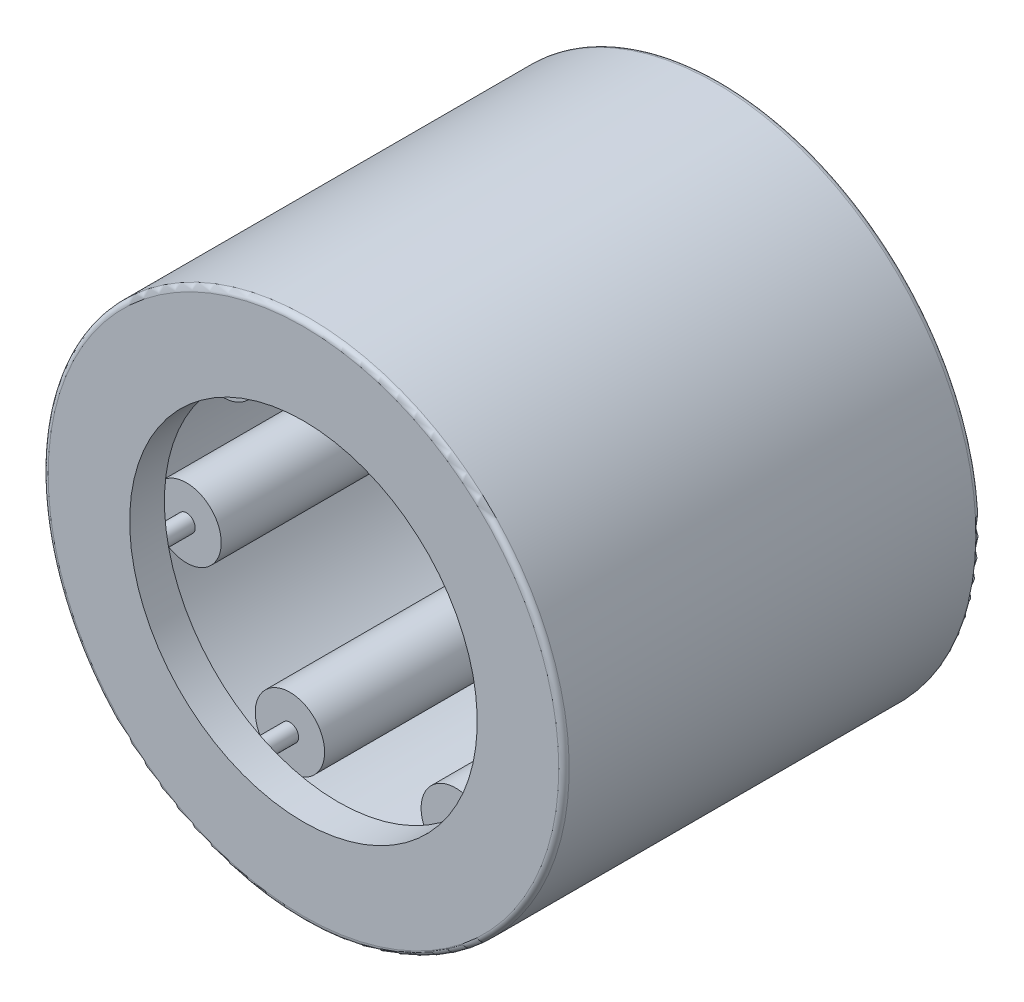
ISO-10303-21;
HEADER;
FILE_DESCRIPTION(('STEP AP214'),'2;1');
FILE_NAME('part.step','',(''),(''),'','','');
FILE_SCHEMA(('AUTOMOTIVE_DESIGN { 1 0 10303 214 1 1 1 1 }'));
ENDSEC;
DATA;
#1=APPLICATION_CONTEXT('core data for automotive mechanical design processes');
#2=APPLICATION_PROTOCOL_DEFINITION('international standard','automotive_design',2000,#1);
#3=PRODUCT_CONTEXT('',#1,'mechanical');
#4=PRODUCT('Part','Part','',(#3));
#5=PRODUCT_RELATED_PRODUCT_CATEGORY('part','',(#4));
#6=PRODUCT_DEFINITION_FORMATION('','',#4);
#7=PRODUCT_DEFINITION_CONTEXT('part definition',#1,'design');
#8=PRODUCT_DEFINITION('design','',#6,#7);
#9=PRODUCT_DEFINITION_SHAPE('','',#8);
#10=(LENGTH_UNIT() NAMED_UNIT(*) SI_UNIT(.MILLI.,.METRE.));
#11=(NAMED_UNIT(*) PLANE_ANGLE_UNIT() SI_UNIT($,.RADIAN.));
#12=(NAMED_UNIT(*) SI_UNIT($,.STERADIAN.) SOLID_ANGLE_UNIT());
#13=UNCERTAINTY_MEASURE_WITH_UNIT(LENGTH_MEASURE(1.E-05),#10,'distance_accuracy_value','');
#14=(GEOMETRIC_REPRESENTATION_CONTEXT(3) GLOBAL_UNCERTAINTY_ASSIGNED_CONTEXT((#13)) GLOBAL_UNIT_ASSIGNED_CONTEXT((#10,
#11,#12)) REPRESENTATION_CONTEXT('',''));
#15=CARTESIAN_POINT('',(0.,0.,0.));
#16=DIRECTION('',(0.,0.,1.));
#17=DIRECTION('',(1.,0.,0.));
#18=AXIS2_PLACEMENT_3D('',#15,#16,#17);
#19=CARTESIAN_POINT('',(-3.386112150569,2.70033433185022,-2.669));
#20=DIRECTION('',(0.,0.,1.));
#21=DIRECTION('',(0.781831482468022,-0.623489801858743,0.));
#22=AXIS2_PLACEMENT_3D('',#19,#20,#21);
#23=PLANE('',#22);
#24=CARTESIAN_POINT('',(-2.86580329898654,2.28540186871322,-2.669));
#25=DIRECTION('',(0.,0.,1.));
#26=DIRECTION('',(0.781831482468022,-0.623489801858743,0.));
#27=AXIS2_PLACEMENT_3D('',#24,#25,#26);
#28=CIRCLE('',#27,0.665499999999999);
#29=CARTESIAN_POINT('',(-2.34549444740407,1.87046940557623,-2.669));
#30=VERTEX_POINT('',#29);
#31=EDGE_CURVE('E11',#30,#30,#28,.T.);
#32=ORIENTED_EDGE('',*,*,#31,.F.);
#33=EDGE_LOOP('',(#32));
#34=FACE_BOUND('',#33,.T.);
#35=CARTESIAN_POINT('',(-2.86580329898654,2.28540186871322,-2.669));
#36=DIRECTION('',(0.,0.,1.));
#37=DIRECTION('',(0.781831482468022,-0.623489801858743,0.));
#38=AXIS2_PLACEMENT_3D('',#35,#36,#37);
#39=CIRCLE('',#38,0.166374999999999);
#40=CARTESIAN_POINT('',(-2.73572608609092,2.18166875292898,-2.669));
#41=VERTEX_POINT('',#40);
#42=EDGE_CURVE('E55',#41,#41,#39,.T.);
#43=ORIENTED_EDGE('',*,*,#42,.T.);
#44=EDGE_LOOP('',(#43));
#45=FACE_BOUND('',#44,.T.);
#46=ADVANCED_FACE('F41',(#34,#45),#23,.F.);
#47=CARTESIAN_POINT('',(-2.86580329898654,2.28540186871322,2.669));
#48=DIRECTION('',(0.,0.,1.));
#49=DIRECTION('',(0.781831482468022,-0.623489801858743,0.));
#50=AXIS2_PLACEMENT_3D('',#47,#48,#49);
#51=CYLINDRICAL_SURFACE('',#50,0.665499999999999);
#52=CARTESIAN_POINT('',(-2.86580329898654,2.28540186871322,2.669));
#53=DIRECTION('',(0.,0.,1.));
#54=DIRECTION('',(0.781831482468022,-0.623489801858743,0.));
#55=AXIS2_PLACEMENT_3D('',#52,#53,#54);
#56=CIRCLE('',#55,0.665499999999999);
#57=CARTESIAN_POINT('',(-2.34549444740407,1.87046940557623,2.669));
#58=VERTEX_POINT('',#57);
#59=EDGE_CURVE('E47',#58,#58,#56,.T.);
#60=ORIENTED_EDGE('',*,*,#59,.F.);
#61=EDGE_LOOP('',(#60));
#62=FACE_BOUND('',#61,.T.);
#63=ORIENTED_EDGE('',*,*,#31,.T.);
#64=EDGE_LOOP('',(#63));
#65=FACE_BOUND('',#64,.T.);
#66=ADVANCED_FACE('F70',(#62,#65),#51,.T.);
#67=CARTESIAN_POINT('',(-3.386112150569,2.70033433185022,2.669));
#68=DIRECTION('',(0.,0.,-1.));
#69=DIRECTION('',(-0.781831482468022,0.623489801858743,0.));
#70=AXIS2_PLACEMENT_3D('',#67,#68,#69);
#71=PLANE('',#70);
#72=CARTESIAN_POINT('',(-2.86580329898654,2.28540186871322,2.669));
#73=DIRECTION('',(0.,0.,1.));
#74=DIRECTION('',(0.781831482468022,-0.623489801858743,0.));
#75=AXIS2_PLACEMENT_3D('',#72,#73,#74);
#76=CIRCLE('',#75,0.166374999999999);
#77=CARTESIAN_POINT('',(-2.73572608609092,2.18166875292898,2.669));
#78=VERTEX_POINT('',#77);
#79=EDGE_CURVE('E51',#78,#78,#76,.T.);
#80=ORIENTED_EDGE('',*,*,#79,.F.);
#81=EDGE_LOOP('',(#80));
#82=FACE_BOUND('',#81,.T.);
#83=ORIENTED_EDGE('',*,*,#59,.T.);
#84=EDGE_LOOP('',(#83));
#85=FACE_BOUND('',#84,.T.);
#86=ADVANCED_FACE('F65',(#82,#85),#71,.F.);
#87=CARTESIAN_POINT('',(-2.86580329898654,2.28540186871322,2.669));
#88=DIRECTION('',(0.,0.,1.));
#89=DIRECTION('',(0.781831482468022,-0.623489801858743,0.));
#90=AXIS2_PLACEMENT_3D('',#87,#88,#89);
#91=CYLINDRICAL_SURFACE('',#90,0.166374999999999);
#92=ORIENTED_EDGE('',*,*,#42,.F.);
#93=EDGE_LOOP('',(#92));
#94=FACE_BOUND('',#93,.T.);
#95=ORIENTED_EDGE('',*,*,#79,.T.);
#96=EDGE_LOOP('',(#95));
#97=FACE_BOUND('',#96,.T.);
#98=ADVANCED_FACE('F62',(#94,#97),#91,.F.);
#99=CLOSED_SHELL('',(#46,#66,#86,#98));
#100=MANIFOLD_SOLID_BREP('B2',#99);
#101=CARTESIAN_POINT('',(-4.22241278765949,-0.963738164964757,-2.669));
#102=DIRECTION('',(0.,0.,1.));
#103=DIRECTION('',(0.974927912181826,0.222520933956305,0.));
#104=AXIS2_PLACEMENT_3D('',#101,#102,#103);
#105=PLANE('',#104);
#106=CARTESIAN_POINT('',(-3.57359826210248,-0.815650483416836,-2.669));
#107=DIRECTION('',(0.,0.,1.));
#108=DIRECTION('',(0.974927912181826,0.222520933956305,0.));
#109=AXIS2_PLACEMENT_3D('',#106,#107,#108);
#110=CIRCLE('',#109,0.665499999999999);
#111=CARTESIAN_POINT('',(-2.92478373654548,-0.667562801868916,-2.669));
#112=VERTEX_POINT('',#111);
#113=EDGE_CURVE('E40',#112,#112,#110,.T.);
#114=ORIENTED_EDGE('',*,*,#113,.F.);
#115=EDGE_LOOP('',(#114));
#116=FACE_BOUND('',#115,.T.);
#117=CARTESIAN_POINT('',(-3.57359826210248,-0.815650483416836,-2.669));
#118=DIRECTION('',(0.,0.,1.));
#119=DIRECTION('',(0.974927912181826,0.222520933956305,0.));
#120=AXIS2_PLACEMENT_3D('',#117,#118,#119);
#121=CIRCLE('',#120,0.166374999999999);
#122=CARTESIAN_POINT('',(-3.41139463071323,-0.778628563029856,-2.669));
#123=VERTEX_POINT('',#122);
#124=EDGE_CURVE('E124',#123,#123,#121,.T.);
#125=ORIENTED_EDGE('',*,*,#124,.T.);
#126=EDGE_LOOP('',(#125));
#127=FACE_BOUND('',#126,.T.);
#128=ADVANCED_FACE('F110',(#116,#127),#105,.F.);
#129=CARTESIAN_POINT('',(-3.57359826210248,-0.815650483416836,2.669));
#130=DIRECTION('',(0.,0.,1.));
#131=DIRECTION('',(0.974927912181826,0.222520933956305,0.));
#132=AXIS2_PLACEMENT_3D('',#129,#130,#131);
#133=CYLINDRICAL_SURFACE('',#132,0.665499999999999);
#134=CARTESIAN_POINT('',(-3.57359826210248,-0.815650483416836,2.669));
#135=DIRECTION('',(0.,0.,1.));
#136=DIRECTION('',(0.974927912181826,0.222520933956305,0.));
#137=AXIS2_PLACEMENT_3D('',#134,#135,#136);
#138=CIRCLE('',#137,0.665499999999999);
#139=CARTESIAN_POINT('',(-2.92478373654548,-0.667562801868915,2.669));
#140=VERTEX_POINT('',#139);
#141=EDGE_CURVE('E116',#140,#140,#138,.T.);
#142=ORIENTED_EDGE('',*,*,#141,.F.);
#143=EDGE_LOOP('',(#142));
#144=FACE_BOUND('',#143,.T.);
#145=ORIENTED_EDGE('',*,*,#113,.T.);
#146=EDGE_LOOP('',(#145));
#147=FACE_BOUND('',#146,.T.);
#148=ADVANCED_FACE('F139',(#144,#147),#133,.T.);
#149=CARTESIAN_POINT('',(-4.22241278765949,-0.963738164964757,2.669));
#150=DIRECTION('',(0.,0.,-1.));
#151=DIRECTION('',(-0.974927912181826,-0.222520933956305,0.));
#152=AXIS2_PLACEMENT_3D('',#149,#150,#151);
#153=PLANE('',#152);
#154=CARTESIAN_POINT('',(-3.57359826210248,-0.815650483416836,2.669));
#155=DIRECTION('',(0.,0.,1.));
#156=DIRECTION('',(0.974927912181826,0.222520933956305,0.));
#157=AXIS2_PLACEMENT_3D('',#154,#155,#156);
#158=CIRCLE('',#157,0.166374999999999);
#159=CARTESIAN_POINT('',(-3.41139463071323,-0.778628563029856,2.669));
#160=VERTEX_POINT('',#159);
#161=EDGE_CURVE('E120',#160,#160,#158,.T.);
#162=ORIENTED_EDGE('',*,*,#161,.F.);
#163=EDGE_LOOP('',(#162));
#164=FACE_BOUND('',#163,.T.);
#165=ORIENTED_EDGE('',*,*,#141,.T.);
#166=EDGE_LOOP('',(#165));
#167=FACE_BOUND('',#166,.T.);
#168=ADVANCED_FACE('F134',(#164,#167),#153,.F.);
#169=CARTESIAN_POINT('',(-3.57359826210248,-0.815650483416836,2.669));
#170=DIRECTION('',(0.,0.,1.));
#171=DIRECTION('',(0.974927912181826,0.222520933956305,0.));
#172=AXIS2_PLACEMENT_3D('',#169,#170,#171);
#173=CYLINDRICAL_SURFACE('',#172,0.166374999999999);
#174=ORIENTED_EDGE('',*,*,#124,.F.);
#175=EDGE_LOOP('',(#174));
#176=FACE_BOUND('',#175,.T.);
#177=ORIENTED_EDGE('',*,*,#161,.T.);
#178=EDGE_LOOP('',(#177));
#179=FACE_BOUND('',#178,.T.);
#180=ADVANCED_FACE('F131',(#176,#179),#173,.F.);
#181=CLOSED_SHELL('',(#128,#148,#168,#180));
#182=MANIFOLD_SOLID_BREP('B6',#181);
#183=CARTESIAN_POINT('',(-1.87915047411818,-3.90209616688536,-2.669));
#184=DIRECTION('',(0.,0.,1.));
#185=DIRECTION('',(0.433883739117565,0.900968867902416,0.));
#186=AXIS2_PLACEMENT_3D('',#183,#184,#185);
#187=PLANE('',#186);
#188=CARTESIAN_POINT('',(-1.59040084573544,-3.30250138529631,-2.669));
#189=DIRECTION('',(0.,0.,1.));
#190=DIRECTION('',(0.433883739117565,0.900968867902416,0.));
#191=AXIS2_PLACEMENT_3D('',#188,#189,#190);
#192=CIRCLE('',#191,0.665499999999999);
#193=CARTESIAN_POINT('',(-1.3016512173527,-2.70290660370725,-2.669));
#194=VERTEX_POINT('',#193);
#195=EDGE_CURVE('E109',#194,#194,#192,.T.);
#196=ORIENTED_EDGE('',*,*,#195,.F.);
#197=EDGE_LOOP('',(#196));
#198=FACE_BOUND('',#197,.T.);
#199=CARTESIAN_POINT('',(-1.59040084573544,-3.30250138529631,-2.669));
#200=DIRECTION('',(0.,0.,1.));
#201=DIRECTION('',(0.433883739117565,0.900968867902416,0.));
#202=AXIS2_PLACEMENT_3D('',#199,#200,#201);
#203=CIRCLE('',#202,0.166374999999999);
#204=CARTESIAN_POINT('',(-1.51821343863975,-3.15260268989904,-2.669));
#205=VERTEX_POINT('',#204);
#206=EDGE_CURVE('E193',#205,#205,#203,.T.);
#207=ORIENTED_EDGE('',*,*,#206,.T.);
#208=EDGE_LOOP('',(#207));
#209=FACE_BOUND('',#208,.T.);
#210=ADVANCED_FACE('F179',(#198,#209),#187,.F.);
#211=CARTESIAN_POINT('',(-1.59040084573544,-3.3025013852963,2.669));
#212=DIRECTION('',(0.,0.,1.));
#213=DIRECTION('',(0.433883739117565,0.900968867902416,0.));
#214=AXIS2_PLACEMENT_3D('',#211,#212,#213);
#215=CYLINDRICAL_SURFACE('',#214,0.665499999999999);
#216=CARTESIAN_POINT('',(-1.59040084573544,-3.3025013852963,2.669));
#217=DIRECTION('',(0.,0.,1.));
#218=DIRECTION('',(0.433883739117565,0.900968867902416,0.));
#219=AXIS2_PLACEMENT_3D('',#216,#217,#218);
#220=CIRCLE('',#219,0.665499999999999);
#221=CARTESIAN_POINT('',(-1.3016512173527,-2.70290660370725,2.669));
#222=VERTEX_POINT('',#221);
#223=EDGE_CURVE('E185',#222,#222,#220,.T.);
#224=ORIENTED_EDGE('',*,*,#223,.F.);
#225=EDGE_LOOP('',(#224));
#226=FACE_BOUND('',#225,.T.);
#227=ORIENTED_EDGE('',*,*,#195,.T.);
#228=EDGE_LOOP('',(#227));
#229=FACE_BOUND('',#228,.T.);
#230=ADVANCED_FACE('F208',(#226,#229),#215,.T.);
#231=CARTESIAN_POINT('',(-1.87915047411817,-3.90209616688536,2.669));
#232=DIRECTION('',(0.,0.,-1.));
#233=DIRECTION('',(-0.433883739117565,-0.900968867902416,0.));
#234=AXIS2_PLACEMENT_3D('',#231,#232,#233);
#235=PLANE('',#234);
#236=CARTESIAN_POINT('',(-1.59040084573544,-3.3025013852963,2.669));
#237=DIRECTION('',(0.,0.,1.));
#238=DIRECTION('',(0.433883739117565,0.900968867902416,0.));
#239=AXIS2_PLACEMENT_3D('',#236,#237,#238);
#240=CIRCLE('',#239,0.166374999999999);
#241=CARTESIAN_POINT('',(-1.51821343863975,-3.15260268989904,2.669));
#242=VERTEX_POINT('',#241);
#243=EDGE_CURVE('E189',#242,#242,#240,.T.);
#244=ORIENTED_EDGE('',*,*,#243,.F.);
#245=EDGE_LOOP('',(#244));
#246=FACE_BOUND('',#245,.T.);
#247=ORIENTED_EDGE('',*,*,#223,.T.);
#248=EDGE_LOOP('',(#247));
#249=FACE_BOUND('',#248,.T.);
#250=ADVANCED_FACE('F203',(#246,#249),#235,.F.);
#251=CARTESIAN_POINT('',(-1.59040084573544,-3.3025013852963,2.669));
#252=DIRECTION('',(0.,0.,1.));
#253=DIRECTION('',(0.433883739117565,0.900968867902416,0.));
#254=AXIS2_PLACEMENT_3D('',#251,#252,#253);
#255=CYLINDRICAL_SURFACE('',#254,0.166374999999999);
#256=ORIENTED_EDGE('',*,*,#206,.F.);
#257=EDGE_LOOP('',(#256));
#258=FACE_BOUND('',#257,.T.);
#259=ORIENTED_EDGE('',*,*,#243,.T.);
#260=EDGE_LOOP('',(#259));
#261=FACE_BOUND('',#260,.T.);
#262=ADVANCED_FACE('F200',(#258,#261),#255,.F.);
#263=CLOSED_SHELL('',(#210,#230,#250,#262));
#264=MANIFOLD_SOLID_BREP('B35',#263);
#265=CARTESIAN_POINT('',(1.87915047411812,-3.90209616688539,-2.669));
#266=DIRECTION('',(0.,0.,1.));
#267=DIRECTION('',(-0.433883739117553,0.900968867902422,0.));
#268=AXIS2_PLACEMENT_3D('',#265,#266,#267);
#269=PLANE('',#268);
#270=CARTESIAN_POINT('',(1.59040084573539,-3.30250138529633,-2.669));
#271=DIRECTION('',(0.,0.,1.));
#272=DIRECTION('',(-0.433883739117553,0.900968867902422,0.));
#273=AXIS2_PLACEMENT_3D('',#270,#271,#272);
#274=CIRCLE('',#273,0.665499999999999);
#275=CARTESIAN_POINT('',(1.30165121735266,-2.70290660370727,-2.669));
#276=VERTEX_POINT('',#275);
#277=EDGE_CURVE('E178',#276,#276,#274,.T.);
#278=ORIENTED_EDGE('',*,*,#277,.F.);
#279=EDGE_LOOP('',(#278));
#280=FACE_BOUND('',#279,.T.);
#281=CARTESIAN_POINT('',(1.59040084573539,-3.30250138529633,-2.669));
#282=DIRECTION('',(0.,0.,1.));
#283=DIRECTION('',(-0.433883739117553,0.900968867902422,0.));
#284=AXIS2_PLACEMENT_3D('',#281,#282,#283);
#285=CIRCLE('',#284,0.166374999999999);
#286=CARTESIAN_POINT('',(1.51821343863971,-3.15260268989906,-2.669));
#287=VERTEX_POINT('',#286);
#288=EDGE_CURVE('E262',#287,#287,#285,.T.);
#289=ORIENTED_EDGE('',*,*,#288,.T.);
#290=EDGE_LOOP('',(#289));
#291=FACE_BOUND('',#290,.T.);
#292=ADVANCED_FACE('F248',(#280,#291),#269,.F.);
#293=CARTESIAN_POINT('',(1.59040084573539,-3.30250138529633,2.669));
#294=DIRECTION('',(0.,0.,1.));
#295=DIRECTION('',(-0.433883739117553,0.900968867902422,0.));
#296=AXIS2_PLACEMENT_3D('',#293,#294,#295);
#297=CYLINDRICAL_SURFACE('',#296,0.665499999999999);
#298=CARTESIAN_POINT('',(1.59040084573539,-3.30250138529633,2.669));
#299=DIRECTION('',(0.,0.,1.));
#300=DIRECTION('',(-0.433883739117553,0.900968867902422,0.));
#301=AXIS2_PLACEMENT_3D('',#298,#299,#300);
#302=CIRCLE('',#301,0.665499999999999);
#303=CARTESIAN_POINT('',(1.30165121735266,-2.70290660370727,2.669));
#304=VERTEX_POINT('',#303);
#305=EDGE_CURVE('E254',#304,#304,#302,.T.);
#306=ORIENTED_EDGE('',*,*,#305,.F.);
#307=EDGE_LOOP('',(#306));
#308=FACE_BOUND('',#307,.T.);
#309=ORIENTED_EDGE('',*,*,#277,.T.);
#310=EDGE_LOOP('',(#309));
#311=FACE_BOUND('',#310,.T.);
#312=ADVANCED_FACE('F277',(#308,#311),#297,.T.);
#313=CARTESIAN_POINT('',(1.87915047411812,-3.90209616688539,2.669));
#314=DIRECTION('',(0.,0.,-1.));
#315=DIRECTION('',(0.433883739117553,-0.900968867902422,0.));
#316=AXIS2_PLACEMENT_3D('',#313,#314,#315);
#317=PLANE('',#316);
#318=CARTESIAN_POINT('',(1.59040084573539,-3.30250138529633,2.669));
#319=DIRECTION('',(0.,0.,1.));
#320=DIRECTION('',(-0.433883739117553,0.900968867902422,0.));
#321=AXIS2_PLACEMENT_3D('',#318,#319,#320);
#322=CIRCLE('',#321,0.166374999999999);
#323=CARTESIAN_POINT('',(1.51821343863971,-3.15260268989906,2.669));
#324=VERTEX_POINT('',#323);
#325=EDGE_CURVE('E258',#324,#324,#322,.T.);
#326=ORIENTED_EDGE('',*,*,#325,.F.);
#327=EDGE_LOOP('',(#326));
#328=FACE_BOUND('',#327,.T.);
#329=ORIENTED_EDGE('',*,*,#305,.T.);
#330=EDGE_LOOP('',(#329));
#331=FACE_BOUND('',#330,.T.);
#332=ADVANCED_FACE('F272',(#328,#331),#317,.F.);
#333=CARTESIAN_POINT('',(1.59040084573539,-3.30250138529633,2.669));
#334=DIRECTION('',(0.,0.,1.));
#335=DIRECTION('',(-0.433883739117553,0.900968867902422,0.));
#336=AXIS2_PLACEMENT_3D('',#333,#334,#335);
#337=CYLINDRICAL_SURFACE('',#336,0.166374999999999);
#338=ORIENTED_EDGE('',*,*,#288,.F.);
#339=EDGE_LOOP('',(#338));
#340=FACE_BOUND('',#339,.T.);
#341=ORIENTED_EDGE('',*,*,#325,.T.);
#342=EDGE_LOOP('',(#341));
#343=FACE_BOUND('',#342,.T.);
#344=ADVANCED_FACE('F269',(#340,#343),#337,.F.);
#345=CLOSED_SHELL('',(#292,#312,#332,#344));
#346=MANIFOLD_SOLID_BREP('B104',#345);
#347=CARTESIAN_POINT('',(4.22241278765947,-0.963738164964814,-2.669));
#348=DIRECTION('',(0.,0.,1.));
#349=DIRECTION('',(-0.974927912181823,0.222520933956318,0.));
#350=AXIS2_PLACEMENT_3D('',#347,#348,#349);
#351=PLANE('',#350);
#352=CARTESIAN_POINT('',(3.57359826210247,-0.815650483416885,-2.669));
#353=DIRECTION('',(0.,0.,1.));
#354=DIRECTION('',(-0.974927912181823,0.222520933956318,0.));
#355=AXIS2_PLACEMENT_3D('',#352,#353,#354);
#356=CIRCLE('',#355,0.665499999999999);
#357=CARTESIAN_POINT('',(2.92478373654547,-0.667562801868955,-2.669));
#358=VERTEX_POINT('',#357);
#359=EDGE_CURVE('E247',#358,#358,#356,.T.);
#360=ORIENTED_EDGE('',*,*,#359,.F.);
#361=EDGE_LOOP('',(#360));
#362=FACE_BOUND('',#361,.T.);
#363=CARTESIAN_POINT('',(3.57359826210247,-0.815650483416885,-2.669));
#364=DIRECTION('',(0.,0.,1.));
#365=DIRECTION('',(-0.974927912181823,0.222520933956318,0.));
#366=AXIS2_PLACEMENT_3D('',#363,#364,#365);
#367=CIRCLE('',#366,0.166374999999999);
#368=CARTESIAN_POINT('',(3.41139463071322,-0.778628563029902,-2.669));
#369=VERTEX_POINT('',#368);
#370=EDGE_CURVE('E331',#369,#369,#367,.T.);
#371=ORIENTED_EDGE('',*,*,#370,.T.);
#372=EDGE_LOOP('',(#371));
#373=FACE_BOUND('',#372,.T.);
#374=ADVANCED_FACE('F317',(#362,#373),#351,.F.);
#375=CARTESIAN_POINT('',(3.57359826210247,-0.815650483416885,2.669));
#376=DIRECTION('',(0.,0.,1.));
#377=DIRECTION('',(-0.974927912181823,0.222520933956318,0.));
#378=AXIS2_PLACEMENT_3D('',#375,#376,#377);
#379=CYLINDRICAL_SURFACE('',#378,0.665499999999999);
#380=CARTESIAN_POINT('',(3.57359826210247,-0.815650483416885,2.669));
#381=DIRECTION('',(0.,0.,1.));
#382=DIRECTION('',(-0.974927912181823,0.222520933956318,0.));
#383=AXIS2_PLACEMENT_3D('',#380,#381,#382);
#384=CIRCLE('',#383,0.665499999999999);
#385=CARTESIAN_POINT('',(2.92478373654547,-0.667562801868955,2.669));
#386=VERTEX_POINT('',#385);
#387=EDGE_CURVE('E323',#386,#386,#384,.T.);
#388=ORIENTED_EDGE('',*,*,#387,.F.);
#389=EDGE_LOOP('',(#388));
#390=FACE_BOUND('',#389,.T.);
#391=ORIENTED_EDGE('',*,*,#359,.T.);
#392=EDGE_LOOP('',(#391));
#393=FACE_BOUND('',#392,.T.);
#394=ADVANCED_FACE('F346',(#390,#393),#379,.T.);
#395=CARTESIAN_POINT('',(4.22241278765947,-0.963738164964814,2.669));
#396=DIRECTION('',(0.,0.,-1.));
#397=DIRECTION('',(0.974927912181823,-0.222520933956318,0.));
#398=AXIS2_PLACEMENT_3D('',#395,#396,#397);
#399=PLANE('',#398);
#400=CARTESIAN_POINT('',(3.57359826210247,-0.815650483416885,2.669));
#401=DIRECTION('',(0.,0.,1.));
#402=DIRECTION('',(-0.974927912181823,0.222520933956318,0.));
#403=AXIS2_PLACEMENT_3D('',#400,#401,#402);
#404=CIRCLE('',#403,0.166374999999999);
#405=CARTESIAN_POINT('',(3.41139463071322,-0.778628563029902,2.669));
#406=VERTEX_POINT('',#405);
#407=EDGE_CURVE('E327',#406,#406,#404,.T.);
#408=ORIENTED_EDGE('',*,*,#407,.F.);
#409=EDGE_LOOP('',(#408));
#410=FACE_BOUND('',#409,.T.);
#411=ORIENTED_EDGE('',*,*,#387,.T.);
#412=EDGE_LOOP('',(#411));
#413=FACE_BOUND('',#412,.T.);
#414=ADVANCED_FACE('F341',(#410,#413),#399,.F.);
#415=CARTESIAN_POINT('',(3.57359826210247,-0.815650483416885,2.669));
#416=DIRECTION('',(0.,0.,1.));
#417=DIRECTION('',(-0.974927912181823,0.222520933956318,0.));
#418=AXIS2_PLACEMENT_3D('',#415,#416,#417);
#419=CYLINDRICAL_SURFACE('',#418,0.166374999999999);
#420=ORIENTED_EDGE('',*,*,#370,.F.);
#421=EDGE_LOOP('',(#420));
#422=FACE_BOUND('',#421,.T.);
#423=ORIENTED_EDGE('',*,*,#407,.T.);
#424=EDGE_LOOP('',(#423));
#425=FACE_BOUND('',#424,.T.);
#426=ADVANCED_FACE('F338',(#422,#425),#419,.F.);
#427=CLOSED_SHELL('',(#374,#394,#414,#426));
#428=MANIFOLD_SOLID_BREP('B173',#427);
#429=CARTESIAN_POINT('',(3.38611215056904,2.70033433185017,-2.669));
#430=DIRECTION('',(0.,0.,1.));
#431=DIRECTION('',(-0.781831482468031,-0.623489801858732,0.));
#432=AXIS2_PLACEMENT_3D('',#429,#430,#431);
#433=PLANE('',#432);
#434=CARTESIAN_POINT('',(2.86580329898657,2.28540186871318,-2.669));
#435=DIRECTION('',(0.,0.,1.));
#436=DIRECTION('',(-0.781831482468031,-0.623489801858732,0.));
#437=AXIS2_PLACEMENT_3D('',#434,#435,#436);
#438=CIRCLE('',#437,0.665499999999999);
#439=CARTESIAN_POINT('',(2.34549444740409,1.8704694055762,-2.669));
#440=VERTEX_POINT('',#439);
#441=EDGE_CURVE('E316',#440,#440,#438,.T.);
#442=ORIENTED_EDGE('',*,*,#441,.F.);
#443=EDGE_LOOP('',(#442));
#444=FACE_BOUND('',#443,.T.);
#445=CARTESIAN_POINT('',(2.86580329898657,2.28540186871318,-2.669));
#446=DIRECTION('',(0.,0.,1.));
#447=DIRECTION('',(-0.781831482468031,-0.623489801858732,0.));
#448=AXIS2_PLACEMENT_3D('',#445,#446,#447);
#449=CIRCLE('',#448,0.166374999999999);
#450=CARTESIAN_POINT('',(2.73572608609095,2.18166875292894,-2.669));
#451=VERTEX_POINT('',#450);
#452=EDGE_CURVE('E400',#451,#451,#449,.T.);
#453=ORIENTED_EDGE('',*,*,#452,.T.);
#454=EDGE_LOOP('',(#453));
#455=FACE_BOUND('',#454,.T.);
#456=ADVANCED_FACE('F386',(#444,#455),#433,.F.);
#457=CARTESIAN_POINT('',(2.86580329898657,2.28540186871318,2.669));
#458=DIRECTION('',(0.,0.,1.));
#459=DIRECTION('',(-0.781831482468031,-0.623489801858732,0.));
#460=AXIS2_PLACEMENT_3D('',#457,#458,#459);
#461=CYLINDRICAL_SURFACE('',#460,0.665499999999999);
#462=CARTESIAN_POINT('',(2.86580329898657,2.28540186871318,2.669));
#463=DIRECTION('',(0.,0.,1.));
#464=DIRECTION('',(-0.781831482468031,-0.623489801858732,0.));
#465=AXIS2_PLACEMENT_3D('',#462,#463,#464);
#466=CIRCLE('',#465,0.665499999999999);
#467=CARTESIAN_POINT('',(2.34549444740409,1.8704694055762,2.669));
#468=VERTEX_POINT('',#467);
#469=EDGE_CURVE('E392',#468,#468,#466,.T.);
#470=ORIENTED_EDGE('',*,*,#469,.F.);
#471=EDGE_LOOP('',(#470));
#472=FACE_BOUND('',#471,.T.);
#473=ORIENTED_EDGE('',*,*,#441,.T.);
#474=EDGE_LOOP('',(#473));
#475=FACE_BOUND('',#474,.T.);
#476=ADVANCED_FACE('F415',(#472,#475),#461,.T.);
#477=CARTESIAN_POINT('',(3.38611215056904,2.70033433185017,2.669));
#478=DIRECTION('',(0.,0.,-1.));
#479=DIRECTION('',(0.781831482468031,0.623489801858732,0.));
#480=AXIS2_PLACEMENT_3D('',#477,#478,#479);
#481=PLANE('',#480);
#482=CARTESIAN_POINT('',(2.86580329898657,2.28540186871318,2.669));
#483=DIRECTION('',(0.,0.,1.));
#484=DIRECTION('',(-0.781831482468031,-0.623489801858732,0.));
#485=AXIS2_PLACEMENT_3D('',#482,#483,#484);
#486=CIRCLE('',#485,0.166374999999999);
#487=CARTESIAN_POINT('',(2.73572608609095,2.18166875292894,2.669));
#488=VERTEX_POINT('',#487);
#489=EDGE_CURVE('E396',#488,#488,#486,.T.);
#490=ORIENTED_EDGE('',*,*,#489,.F.);
#491=EDGE_LOOP('',(#490));
#492=FACE_BOUND('',#491,.T.);
#493=ORIENTED_EDGE('',*,*,#469,.T.);
#494=EDGE_LOOP('',(#493));
#495=FACE_BOUND('',#494,.T.);
#496=ADVANCED_FACE('F410',(#492,#495),#481,.F.);
#497=CARTESIAN_POINT('',(2.86580329898657,2.28540186871318,2.669));
#498=DIRECTION('',(0.,0.,1.));
#499=DIRECTION('',(-0.781831482468031,-0.623489801858732,0.));
#500=AXIS2_PLACEMENT_3D('',#497,#498,#499);
#501=CYLINDRICAL_SURFACE('',#500,0.166374999999999);
#502=ORIENTED_EDGE('',*,*,#452,.F.);
#503=EDGE_LOOP('',(#502));
#504=FACE_BOUND('',#503,.T.);
#505=ORIENTED_EDGE('',*,*,#489,.T.);
#506=EDGE_LOOP('',(#505));
#507=FACE_BOUND('',#506,.T.);
#508=ADVANCED_FACE('F407',(#504,#507),#501,.F.);
#509=CLOSED_SHELL('',(#456,#476,#496,#508));
#510=MANIFOLD_SOLID_BREP('B242',#509);
#511=CARTESIAN_POINT('',(-2.86580329898654,2.28540186871322,3.3345));
#512=DIRECTION('',(0.,0.,-1.));
#513=DIRECTION('',(-0.623489801858743,-0.781831482468022,0.));
#514=AXIS2_PLACEMENT_3D('',#511,#512,#513);
#515=PLANE('',#514);
#516=CARTESIAN_POINT('',(-2.86580329898654,2.28540186871322,3.3345));
#517=DIRECTION('',(0.,0.,1.));
#518=DIRECTION('',(0.623489801858743,0.781831482468022,0.));
#519=AXIS2_PLACEMENT_3D('',#516,#517,#518);
#520=CIRCLE('',#519,0.166374999999999);
#521=CARTESIAN_POINT('',(-2.76207018320229,2.41547908160884,3.3345));
#522=VERTEX_POINT('',#521);
#523=EDGE_CURVE('E385',#522,#522,#520,.T.);
#524=ORIENTED_EDGE('',*,*,#523,.T.);
#525=EDGE_LOOP('',(#524));
#526=FACE_BOUND('',#525,.T.);
#527=ADVANCED_FACE('F455',(#526),#515,.F.);
#528=CARTESIAN_POINT('',(-2.86580329898654,2.28540186871322,3.3345));
#529=DIRECTION('',(0.,0.,1.));
#530=DIRECTION('',(0.623489801858743,0.781831482468022,0.));
#531=AXIS2_PLACEMENT_3D('',#528,#529,#530);
#532=CYLINDRICAL_SURFACE('',#531,0.166374999999999);
#533=ORIENTED_EDGE('',*,*,#523,.F.);
#534=EDGE_LOOP('',(#533));
#535=FACE_BOUND('',#534,.T.);
#536=CARTESIAN_POINT('',(-2.86580329898654,2.28540186871322,-3.3345));
#537=DIRECTION('',(0.,0.,1.));
#538=DIRECTION('',(0.623489801858743,0.781831482468022,0.));
#539=AXIS2_PLACEMENT_3D('',#536,#537,#538);
#540=CIRCLE('',#539,0.166374999999999);
#541=CARTESIAN_POINT('',(-2.76207018320229,2.41547908160884,-3.3345));
#542=VERTEX_POINT('',#541);
#543=EDGE_CURVE('E461',#542,#542,#540,.T.);
#544=ORIENTED_EDGE('',*,*,#543,.T.);
#545=EDGE_LOOP('',(#544));
#546=FACE_BOUND('',#545,.T.);
#547=ADVANCED_FACE('F467',(#535,#546),#532,.T.);
#548=CARTESIAN_POINT('',(-2.86580329898654,2.28540186871322,-3.3345));
#549=DIRECTION('',(0.,0.,1.));
#550=DIRECTION('',(0.623489801858743,0.781831482468022,0.));
#551=AXIS2_PLACEMENT_3D('',#548,#549,#550);
#552=PLANE('',#551);
#553=ORIENTED_EDGE('',*,*,#543,.F.);
#554=EDGE_LOOP('',(#553));
#555=FACE_BOUND('',#554,.T.);
#556=ADVANCED_FACE('F469',(#555),#552,.F.);
#557=CLOSED_SHELL('',(#527,#547,#556));
#558=MANIFOLD_SOLID_BREP('B311',#557);
#559=CARTESIAN_POINT('',(-3.57359826210248,-0.815650483416836,3.3345));
#560=DIRECTION('',(0.,0.,-1.));
#561=DIRECTION('',(0.222520933956305,-0.974927912181826,0.));
#562=AXIS2_PLACEMENT_3D('',#559,#560,#561);
#563=PLANE('',#562);
#564=CARTESIAN_POINT('',(-3.57359826210248,-0.815650483416836,3.3345));
#565=DIRECTION('',(0.,0.,1.));
#566=DIRECTION('',(-0.222520933956305,0.974927912181826,0.));
#567=AXIS2_PLACEMENT_3D('',#564,#565,#566);
#568=CIRCLE('',#567,0.166374999999999);
#569=CARTESIAN_POINT('',(-3.61062018248946,-0.653446852027586,3.3345));
#570=VERTEX_POINT('',#569);
#571=EDGE_CURVE('E454',#570,#570,#568,.T.);
#572=ORIENTED_EDGE('',*,*,#571,.T.);
#573=EDGE_LOOP('',(#572));
#574=FACE_BOUND('',#573,.T.);
#575=ADVANCED_FACE('F503',(#574),#563,.F.);
#576=CARTESIAN_POINT('',(-3.57359826210248,-0.815650483416836,3.3345));
#577=DIRECTION('',(0.,0.,1.));
#578=DIRECTION('',(-0.222520933956305,0.974927912181826,0.));
#579=AXIS2_PLACEMENT_3D('',#576,#577,#578);
#580=CYLINDRICAL_SURFACE('',#579,0.166374999999999);
#581=ORIENTED_EDGE('',*,*,#571,.F.);
#582=EDGE_LOOP('',(#581));
#583=FACE_BOUND('',#582,.T.);
#584=CARTESIAN_POINT('',(-3.57359826210248,-0.815650483416836,-3.3345));
#585=DIRECTION('',(0.,0.,1.));
#586=DIRECTION('',(-0.222520933956305,0.974927912181826,0.));
#587=AXIS2_PLACEMENT_3D('',#584,#585,#586);
#588=CIRCLE('',#587,0.166374999999999);
#589=CARTESIAN_POINT('',(-3.61062018248946,-0.653446852027586,-3.3345));
#590=VERTEX_POINT('',#589);
#591=EDGE_CURVE('E509',#590,#590,#588,.T.);
#592=ORIENTED_EDGE('',*,*,#591,.T.);
#593=EDGE_LOOP('',(#592));
#594=FACE_BOUND('',#593,.T.);
#595=ADVANCED_FACE('F515',(#583,#594),#580,.T.);
#596=CARTESIAN_POINT('',(-3.57359826210248,-0.815650483416836,-3.3345));
#597=DIRECTION('',(0.,0.,1.));
#598=DIRECTION('',(-0.222520933956305,0.974927912181826,0.));
#599=AXIS2_PLACEMENT_3D('',#596,#597,#598);
#600=PLANE('',#599);
#601=ORIENTED_EDGE('',*,*,#591,.F.);
#602=EDGE_LOOP('',(#601));
#603=FACE_BOUND('',#602,.T.);
#604=ADVANCED_FACE('F517',(#603),#600,.F.);
#605=CLOSED_SHELL('',(#575,#595,#604));
#606=MANIFOLD_SOLID_BREP('B380',#605);
#607=CARTESIAN_POINT('',(-1.59040084573544,-3.30250138529631,3.3345));
#608=DIRECTION('',(0.,0.,-1.));
#609=DIRECTION('',(0.900968867902416,-0.433883739117565,0.));
#610=AXIS2_PLACEMENT_3D('',#607,#608,#609);
#611=PLANE('',#610);
#612=CARTESIAN_POINT('',(-1.59040084573544,-3.30250138529631,3.3345));
#613=DIRECTION('',(0.,0.,1.));
#614=DIRECTION('',(-0.900968867902416,0.433883739117565,0.));
#615=AXIS2_PLACEMENT_3D('',#612,#613,#614);
#616=CIRCLE('',#615,0.166374999999999);
#617=CARTESIAN_POINT('',(-1.7402995411327,-3.23031397820062,3.3345));
#618=VERTEX_POINT('',#617);
#619=EDGE_CURVE('E502',#618,#618,#616,.T.);
#620=ORIENTED_EDGE('',*,*,#619,.T.);
#621=EDGE_LOOP('',(#620));
#622=FACE_BOUND('',#621,.T.);
#623=ADVANCED_FACE('F551',(#622),#611,.F.);
#624=CARTESIAN_POINT('',(-1.59040084573544,-3.30250138529631,3.3345));
#625=DIRECTION('',(0.,0.,1.));
#626=DIRECTION('',(-0.900968867902416,0.433883739117565,0.));
#627=AXIS2_PLACEMENT_3D('',#624,#625,#626);
#628=CYLINDRICAL_SURFACE('',#627,0.166374999999999);
#629=ORIENTED_EDGE('',*,*,#619,.F.);
#630=EDGE_LOOP('',(#629));
#631=FACE_BOUND('',#630,.T.);
#632=CARTESIAN_POINT('',(-1.59040084573544,-3.30250138529631,-3.3345));
#633=DIRECTION('',(0.,0.,1.));
#634=DIRECTION('',(-0.900968867902416,0.433883739117565,0.));
#635=AXIS2_PLACEMENT_3D('',#632,#633,#634);
#636=CIRCLE('',#635,0.166374999999999);
#637=CARTESIAN_POINT('',(-1.7402995411327,-3.23031397820062,-3.3345));
#638=VERTEX_POINT('',#637);
#639=EDGE_CURVE('E557',#638,#638,#636,.T.);
#640=ORIENTED_EDGE('',*,*,#639,.T.);
#641=EDGE_LOOP('',(#640));
#642=FACE_BOUND('',#641,.T.);
#643=ADVANCED_FACE('F563',(#631,#642),#628,.T.);
#644=CARTESIAN_POINT('',(-1.59040084573544,-3.30250138529631,-3.3345));
#645=DIRECTION('',(0.,0.,1.));
#646=DIRECTION('',(-0.900968867902416,0.433883739117565,0.));
#647=AXIS2_PLACEMENT_3D('',#644,#645,#646);
#648=PLANE('',#647);
#649=ORIENTED_EDGE('',*,*,#639,.F.);
#650=EDGE_LOOP('',(#649));
#651=FACE_BOUND('',#650,.T.);
#652=ADVANCED_FACE('F565',(#651),#648,.F.);
#653=CLOSED_SHELL('',(#623,#643,#652));
#654=MANIFOLD_SOLID_BREP('B449',#653);
#655=CARTESIAN_POINT('',(1.59040084573539,-3.30250138529633,3.3345));
#656=DIRECTION('',(0.,0.,-1.));
#657=DIRECTION('',(0.900968867902422,0.433883739117553,0.));
#658=AXIS2_PLACEMENT_3D('',#655,#656,#657);
#659=PLANE('',#658);
#660=CARTESIAN_POINT('',(1.59040084573539,-3.30250138529633,3.3345));
#661=DIRECTION('',(0.,0.,1.));
#662=DIRECTION('',(-0.900968867902422,-0.433883739117553,0.));
#663=AXIS2_PLACEMENT_3D('',#660,#661,#662);
#664=CIRCLE('',#663,0.166374999999999);
#665=CARTESIAN_POINT('',(1.44050215033812,-3.37468879239201,3.3345));
#666=VERTEX_POINT('',#665);
#667=EDGE_CURVE('E550',#666,#666,#664,.T.);
#668=ORIENTED_EDGE('',*,*,#667,.T.);
#669=EDGE_LOOP('',(#668));
#670=FACE_BOUND('',#669,.T.);
#671=ADVANCED_FACE('F599',(#670),#659,.F.);
#672=CARTESIAN_POINT('',(1.59040084573539,-3.30250138529633,3.3345));
#673=DIRECTION('',(0.,0.,1.));
#674=DIRECTION('',(-0.900968867902422,-0.433883739117553,0.));
#675=AXIS2_PLACEMENT_3D('',#672,#673,#674);
#676=CYLINDRICAL_SURFACE('',#675,0.166374999999999);
#677=ORIENTED_EDGE('',*,*,#667,.F.);
#678=EDGE_LOOP('',(#677));
#679=FACE_BOUND('',#678,.T.);
#680=CARTESIAN_POINT('',(1.59040084573539,-3.30250138529633,-3.3345));
#681=DIRECTION('',(0.,0.,1.));
#682=DIRECTION('',(-0.900968867902422,-0.433883739117553,0.));
#683=AXIS2_PLACEMENT_3D('',#680,#681,#682);
#684=CIRCLE('',#683,0.166374999999999);
#685=CARTESIAN_POINT('',(1.44050215033812,-3.37468879239201,-3.3345));
#686=VERTEX_POINT('',#685);
#687=EDGE_CURVE('E605',#686,#686,#684,.T.);
#688=ORIENTED_EDGE('',*,*,#687,.T.);
#689=EDGE_LOOP('',(#688));
#690=FACE_BOUND('',#689,.T.);
#691=ADVANCED_FACE('F611',(#679,#690),#676,.T.);
#692=CARTESIAN_POINT('',(1.59040084573539,-3.30250138529633,-3.3345));
#693=DIRECTION('',(0.,0.,1.));
#694=DIRECTION('',(-0.900968867902422,-0.433883739117553,0.));
#695=AXIS2_PLACEMENT_3D('',#692,#693,#694);
#696=PLANE('',#695);
#697=ORIENTED_EDGE('',*,*,#687,.F.);
#698=EDGE_LOOP('',(#697));
#699=FACE_BOUND('',#698,.T.);
#700=ADVANCED_FACE('F613',(#699),#696,.F.);
#701=CLOSED_SHELL('',(#671,#691,#700));
#702=MANIFOLD_SOLID_BREP('B497',#701);
#703=CARTESIAN_POINT('',(3.57359826210247,-0.815650483416885,3.3345));
#704=DIRECTION('',(0.,0.,-1.));
#705=DIRECTION('',(0.222520933956318,0.974927912181823,0.));
#706=AXIS2_PLACEMENT_3D('',#703,#704,#705);
#707=PLANE('',#706);
#708=CARTESIAN_POINT('',(3.57359826210247,-0.815650483416885,3.3345));
#709=DIRECTION('',(0.,0.,1.));
#710=DIRECTION('',(-0.222520933956318,-0.974927912181823,0.));
#711=AXIS2_PLACEMENT_3D('',#708,#709,#710);
#712=CIRCLE('',#711,0.166374999999999);
#713=CARTESIAN_POINT('',(3.53657634171549,-0.977854114806135,3.3345));
#714=VERTEX_POINT('',#713);
#715=EDGE_CURVE('E598',#714,#714,#712,.T.);
#716=ORIENTED_EDGE('',*,*,#715,.T.);
#717=EDGE_LOOP('',(#716));
#718=FACE_BOUND('',#717,.T.);
#719=ADVANCED_FACE('F647',(#718),#707,.F.);
#720=CARTESIAN_POINT('',(3.57359826210247,-0.815650483416885,3.3345));
#721=DIRECTION('',(0.,0.,1.));
#722=DIRECTION('',(-0.222520933956318,-0.974927912181823,0.));
#723=AXIS2_PLACEMENT_3D('',#720,#721,#722);
#724=CYLINDRICAL_SURFACE('',#723,0.166374999999999);
#725=ORIENTED_EDGE('',*,*,#715,.F.);
#726=EDGE_LOOP('',(#725));
#727=FACE_BOUND('',#726,.T.);
#728=CARTESIAN_POINT('',(3.57359826210247,-0.815650483416885,-3.3345));
#729=DIRECTION('',(0.,0.,1.));
#730=DIRECTION('',(-0.222520933956318,-0.974927912181823,0.));
#731=AXIS2_PLACEMENT_3D('',#728,#729,#730);
#732=CIRCLE('',#731,0.166374999999999);
#733=CARTESIAN_POINT('',(3.53657634171549,-0.977854114806135,-3.3345));
#734=VERTEX_POINT('',#733);
#735=EDGE_CURVE('E653',#734,#734,#732,.T.);
#736=ORIENTED_EDGE('',*,*,#735,.T.);
#737=EDGE_LOOP('',(#736));
#738=FACE_BOUND('',#737,.T.);
#739=ADVANCED_FACE('F659',(#727,#738),#724,.T.);
#740=CARTESIAN_POINT('',(3.57359826210247,-0.815650483416885,-3.3345));
#741=DIRECTION('',(0.,0.,1.));
#742=DIRECTION('',(-0.222520933956318,-0.974927912181823,0.));
#743=AXIS2_PLACEMENT_3D('',#740,#741,#742);
#744=PLANE('',#743);
#745=ORIENTED_EDGE('',*,*,#735,.F.);
#746=EDGE_LOOP('',(#745));
#747=FACE_BOUND('',#746,.T.);
#748=ADVANCED_FACE('F661',(#747),#744,.F.);
#749=CLOSED_SHELL('',(#719,#739,#748));
#750=MANIFOLD_SOLID_BREP('B545',#749);
#751=CARTESIAN_POINT('',(2.86580329898657,2.28540186871318,3.3345));
#752=DIRECTION('',(0.,0.,-1.));
#753=DIRECTION('',(-0.623489801858732,0.781831482468031,0.));
#754=AXIS2_PLACEMENT_3D('',#751,#752,#753);
#755=PLANE('',#754);
#756=CARTESIAN_POINT('',(2.86580329898657,2.28540186871318,3.3345));
#757=DIRECTION('',(0.,0.,1.));
#758=DIRECTION('',(0.623489801858732,-0.781831482468031,0.));
#759=AXIS2_PLACEMENT_3D('',#756,#757,#758);
#760=CIRCLE('',#759,0.166374999999999);
#761=CARTESIAN_POINT('',(2.96953641477081,2.15532465581756,3.3345));
#762=VERTEX_POINT('',#761);
#763=EDGE_CURVE('E646',#762,#762,#760,.T.);
#764=ORIENTED_EDGE('',*,*,#763,.T.);
#765=EDGE_LOOP('',(#764));
#766=FACE_BOUND('',#765,.T.);
#767=ADVANCED_FACE('F695',(#766),#755,.F.);
#768=CARTESIAN_POINT('',(2.86580329898657,2.28540186871318,3.3345));
#769=DIRECTION('',(0.,0.,1.));
#770=DIRECTION('',(0.623489801858732,-0.781831482468031,0.));
#771=AXIS2_PLACEMENT_3D('',#768,#769,#770);
#772=CYLINDRICAL_SURFACE('',#771,0.166374999999999);
#773=ORIENTED_EDGE('',*,*,#763,.F.);
#774=EDGE_LOOP('',(#773));
#775=FACE_BOUND('',#774,.T.);
#776=CARTESIAN_POINT('',(2.86580329898657,2.28540186871318,-3.3345));
#777=DIRECTION('',(0.,0.,1.));
#778=DIRECTION('',(0.623489801858732,-0.781831482468031,0.));
#779=AXIS2_PLACEMENT_3D('',#776,#777,#778);
#780=CIRCLE('',#779,0.166374999999999);
#781=CARTESIAN_POINT('',(2.96953641477081,2.15532465581756,-3.3345));
#782=VERTEX_POINT('',#781);
#783=EDGE_CURVE('E701',#782,#782,#780,.T.);
#784=ORIENTED_EDGE('',*,*,#783,.T.);
#785=EDGE_LOOP('',(#784));
#786=FACE_BOUND('',#785,.T.);
#787=ADVANCED_FACE('F707',(#775,#786),#772,.T.);
#788=CARTESIAN_POINT('',(2.86580329898657,2.28540186871318,-3.3345));
#789=DIRECTION('',(0.,0.,1.));
#790=DIRECTION('',(0.623489801858732,-0.781831482468031,0.));
#791=AXIS2_PLACEMENT_3D('',#788,#789,#790);
#792=PLANE('',#791);
#793=ORIENTED_EDGE('',*,*,#783,.F.);
#794=EDGE_LOOP('',(#793));
#795=FACE_BOUND('',#794,.T.);
#796=ADVANCED_FACE('F709',(#795),#792,.F.);
#797=CLOSED_SHELL('',(#767,#787,#796));
#798=MANIFOLD_SOLID_BREP('B593',#797);
#799=CARTESIAN_POINT('',(0.,3.6655,3.3345));
#800=DIRECTION('',(0.,0.,-1.));
#801=DIRECTION('',(-1.,0.,0.));
#802=AXIS2_PLACEMENT_3D('',#799,#800,#801);
#803=PLANE('',#802);
#804=CARTESIAN_POINT('',(0.,3.6655,3.3345));
#805=DIRECTION('',(0.,0.,1.));
#806=DIRECTION('',(1.,0.,0.));
#807=AXIS2_PLACEMENT_3D('',#804,#805,#806);
#808=CIRCLE('',#807,0.166374999999999);
#809=CARTESIAN_POINT('',(0.166374999999999,3.6655,3.3345));
#810=VERTEX_POINT('',#809);
#811=EDGE_CURVE('E694',#810,#810,#808,.T.);
#812=ORIENTED_EDGE('',*,*,#811,.T.);
#813=EDGE_LOOP('',(#812));
#814=FACE_BOUND('',#813,.T.);
#815=ADVANCED_FACE('F743',(#814),#803,.F.);
#816=CARTESIAN_POINT('',(0.,3.6655,3.3345));
#817=DIRECTION('',(0.,0.,1.));
#818=DIRECTION('',(1.,0.,0.));
#819=AXIS2_PLACEMENT_3D('',#816,#817,#818);
#820=CYLINDRICAL_SURFACE('',#819,0.166374999999999);
#821=ORIENTED_EDGE('',*,*,#811,.F.);
#822=EDGE_LOOP('',(#821));
#823=FACE_BOUND('',#822,.T.);
#824=CARTESIAN_POINT('',(0.,3.6655,-3.3345));
#825=DIRECTION('',(0.,0.,1.));
#826=DIRECTION('',(1.,0.,0.));
#827=AXIS2_PLACEMENT_3D('',#824,#825,#826);
#828=CIRCLE('',#827,0.166374999999999);
#829=CARTESIAN_POINT('',(0.166374999999999,3.6655,-3.3345));
#830=VERTEX_POINT('',#829);
#831=EDGE_CURVE('E749',#830,#830,#828,.T.);
#832=ORIENTED_EDGE('',*,*,#831,.T.);
#833=EDGE_LOOP('',(#832));
#834=FACE_BOUND('',#833,.T.);
#835=ADVANCED_FACE('F755',(#823,#834),#820,.T.);
#836=CARTESIAN_POINT('',(0.,3.6655,-3.3345));
#837=DIRECTION('',(0.,0.,1.));
#838=DIRECTION('',(1.,0.,0.));
#839=AXIS2_PLACEMENT_3D('',#836,#837,#838);
#840=PLANE('',#839);
#841=ORIENTED_EDGE('',*,*,#831,.F.);
#842=EDGE_LOOP('',(#841));
#843=FACE_BOUND('',#842,.T.);
#844=ADVANCED_FACE('F757',(#843),#840,.F.);
#845=CLOSED_SHELL('',(#815,#835,#844));
#846=MANIFOLD_SOLID_BREP('B641',#845);
#847=CARTESIAN_POINT('',(0.,4.331,-2.669));
#848=DIRECTION('',(0.,0.,1.));
#849=DIRECTION('',(0.,-1.,0.));
#850=AXIS2_PLACEMENT_3D('',#847,#848,#849);
#851=PLANE('',#850);
#852=CARTESIAN_POINT('',(0.,3.6655,-2.669));
#853=DIRECTION('',(0.,0.,1.));
#854=DIRECTION('',(0.,-1.,0.));
#855=AXIS2_PLACEMENT_3D('',#852,#853,#854);
#856=CIRCLE('',#855,0.665499999999999);
#857=CARTESIAN_POINT('',(0.,3.,-2.669));
#858=VERTEX_POINT('',#857);
#859=EDGE_CURVE('E742',#858,#858,#856,.T.);
#860=ORIENTED_EDGE('',*,*,#859,.F.);
#861=EDGE_LOOP('',(#860));
#862=FACE_BOUND('',#861,.T.);
#863=CARTESIAN_POINT('',(0.,3.6655,-2.669));
#864=DIRECTION('',(0.,0.,1.));
#865=DIRECTION('',(0.,-1.,0.));
#866=AXIS2_PLACEMENT_3D('',#863,#864,#865);
#867=CIRCLE('',#866,0.166374999999999);
#868=CARTESIAN_POINT('',(0.,3.499125,-2.669));
#869=VERTEX_POINT('',#868);
#870=EDGE_CURVE('E804',#869,#869,#867,.T.);
#871=ORIENTED_EDGE('',*,*,#870,.T.);
#872=EDGE_LOOP('',(#871));
#873=FACE_BOUND('',#872,.T.);
#874=ADVANCED_FACE('F790',(#862,#873),#851,.F.);
#875=CARTESIAN_POINT('',(0.,3.6655,2.669));
#876=DIRECTION('',(0.,0.,1.));
#877=DIRECTION('',(0.,-1.,0.));
#878=AXIS2_PLACEMENT_3D('',#875,#876,#877);
#879=CYLINDRICAL_SURFACE('',#878,0.665499999999999);
#880=CARTESIAN_POINT('',(0.,3.6655,2.669));
#881=DIRECTION('',(0.,0.,1.));
#882=DIRECTION('',(0.,-1.,0.));
#883=AXIS2_PLACEMENT_3D('',#880,#881,#882);
#884=CIRCLE('',#883,0.665499999999999);
#885=CARTESIAN_POINT('',(0.,3.,2.669));
#886=VERTEX_POINT('',#885);
#887=EDGE_CURVE('E796',#886,#886,#884,.T.);
#888=ORIENTED_EDGE('',*,*,#887,.F.);
#889=EDGE_LOOP('',(#888));
#890=FACE_BOUND('',#889,.T.);
#891=ORIENTED_EDGE('',*,*,#859,.T.);
#892=EDGE_LOOP('',(#891));
#893=FACE_BOUND('',#892,.T.);
#894=ADVANCED_FACE('F819',(#890,#893),#879,.T.);
#895=CARTESIAN_POINT('',(0.,4.331,2.669));
#896=DIRECTION('',(0.,0.,-1.));
#897=DIRECTION('',(0.,1.,0.));
#898=AXIS2_PLACEMENT_3D('',#895,#896,#897);
#899=PLANE('',#898);
#900=CARTESIAN_POINT('',(0.,3.6655,2.669));
#901=DIRECTION('',(0.,0.,1.));
#902=DIRECTION('',(0.,-1.,0.));
#903=AXIS2_PLACEMENT_3D('',#900,#901,#902);
#904=CIRCLE('',#903,0.166374999999999);
#905=CARTESIAN_POINT('',(0.,3.499125,2.669));
#906=VERTEX_POINT('',#905);
#907=EDGE_CURVE('E800',#906,#906,#904,.T.);
#908=ORIENTED_EDGE('',*,*,#907,.F.);
#909=EDGE_LOOP('',(#908));
#910=FACE_BOUND('',#909,.T.);
#911=ORIENTED_EDGE('',*,*,#887,.T.);
#912=EDGE_LOOP('',(#911));
#913=FACE_BOUND('',#912,.T.);
#914=ADVANCED_FACE('F814',(#910,#913),#899,.F.);
#915=CARTESIAN_POINT('',(0.,3.6655,2.669));
#916=DIRECTION('',(0.,0.,1.));
#917=DIRECTION('',(0.,-1.,0.));
#918=AXIS2_PLACEMENT_3D('',#915,#916,#917);
#919=CYLINDRICAL_SURFACE('',#918,0.166374999999999);
#920=ORIENTED_EDGE('',*,*,#870,.F.);
#921=EDGE_LOOP('',(#920));
#922=FACE_BOUND('',#921,.T.);
#923=ORIENTED_EDGE('',*,*,#907,.T.);
#924=EDGE_LOOP('',(#923));
#925=FACE_BOUND('',#924,.T.);
#926=ADVANCED_FACE('F811',(#922,#925),#919,.F.);
#927=CLOSED_SHELL('',(#874,#894,#914,#926));
#928=MANIFOLD_SOLID_BREP('B689',#927);
#929=CARTESIAN_POINT('',(0.,4.9965,4.));
#930=DIRECTION('',(0.,0.,-1.));
#931=DIRECTION('',(0.,1.,0.));
#932=AXIS2_PLACEMENT_3D('',#929,#930,#931);
#933=PLANE('',#932);
#934=CARTESIAN_POINT('',(0.,0.,4.));
#935=DIRECTION('',(0.,0.,-1.));
#936=DIRECTION('',(0.,1.,0.));
#937=AXIS2_PLACEMENT_3D('',#934,#935,#936);
#938=CIRCLE('',#937,4.89657);
#939=CARTESIAN_POINT('',(0.,4.89657,4.));
#940=VERTEX_POINT('',#939);
#941=EDGE_CURVE('E789',#940,#940,#938,.F.);
#942=ORIENTED_EDGE('',*,*,#941,.T.);
#943=EDGE_LOOP('',(#942));
#944=FACE_BOUND('',#943,.T.);
#945=CARTESIAN_POINT('',(0.,0.,4.));
#946=DIRECTION('',(0.,0.,1.));
#947=DIRECTION('',(0.,-1.,0.));
#948=AXIS2_PLACEMENT_3D('',#945,#946,#947);
#949=CIRCLE('',#948,3.33275);
#950=CARTESIAN_POINT('',(0.,-3.33274999999999,4.));
#951=VERTEX_POINT('',#950);
#952=EDGE_CURVE('E871',#951,#951,#949,.T.);
#953=ORIENTED_EDGE('',*,*,#952,.F.);
#954=EDGE_LOOP('',(#953));
#955=FACE_BOUND('',#954,.T.);
#956=ADVANCED_FACE('F851',(#944,#955),#933,.F.);
#957=CARTESIAN_POINT('',(0.,0.,4.));
#958=DIRECTION('',(0.,0.,1.));
#959=DIRECTION('',(0.,-1.,0.));
#960=AXIS2_PLACEMENT_3D('',#957,#958,#959);
#961=CYLINDRICAL_SURFACE('',#960,3.33275);
#962=CARTESIAN_POINT('',(0.,0.,3.3345));
#963=DIRECTION('',(0.,0.,1.));
#964=DIRECTION('',(0.,-1.,0.));
#965=AXIS2_PLACEMENT_3D('',#962,#963,#964);
#966=CIRCLE('',#965,3.33275);
#967=CARTESIAN_POINT('',(0.,-3.33274999999999,3.3345));
#968=VERTEX_POINT('',#967);
#969=EDGE_CURVE('E874',#968,#968,#966,.T.);
#970=ORIENTED_EDGE('',*,*,#969,.F.);
#971=EDGE_LOOP('',(#970));
#972=FACE_BOUND('',#971,.T.);
#973=ORIENTED_EDGE('',*,*,#952,.T.);
#974=EDGE_LOOP('',(#973));
#975=FACE_BOUND('',#974,.T.);
#976=ADVANCED_FACE('F913',(#972,#975),#961,.F.);
#977=CARTESIAN_POINT('',(0.,3.33275,3.3345));
#978=DIRECTION('',(0.,0.,1.));
#979=DIRECTION('',(0.,-1.,0.));
#980=AXIS2_PLACEMENT_3D('',#977,#978,#979);
#981=PLANE('',#980);
#982=CARTESIAN_POINT('',(0.,0.,3.3345));
#983=DIRECTION('',(0.,0.,1.));
#984=DIRECTION('',(0.,-1.,0.));
#985=AXIS2_PLACEMENT_3D('',#982,#983,#984);
#986=CIRCLE('',#985,4.331);
#987=CARTESIAN_POINT('',(0.,-4.33099999999999,3.3345));
#988=VERTEX_POINT('',#987);
#989=EDGE_CURVE('E877',#988,#988,#986,.T.);
#990=ORIENTED_EDGE('',*,*,#989,.F.);
#991=EDGE_LOOP('',(#990));
#992=FACE_BOUND('',#991,.T.);
#993=ORIENTED_EDGE('',*,*,#969,.T.);
#994=EDGE_LOOP('',(#993));
#995=FACE_BOUND('',#994,.T.);
#996=ADVANCED_FACE('F907',(#992,#995),#981,.F.);
#997=CARTESIAN_POINT('',(0.,0.,4.));
#998=DIRECTION('',(0.,0.,1.));
#999=DIRECTION('',(0.,-1.,0.));
#1000=AXIS2_PLACEMENT_3D('',#997,#998,#999);
#1001=CYLINDRICAL_SURFACE('',#1000,4.331);
#1002=CARTESIAN_POINT('',(0.,0.,-3.3345));
#1003=DIRECTION('',(0.,0.,1.));
#1004=DIRECTION('',(0.,-1.,0.));
#1005=AXIS2_PLACEMENT_3D('',#1002,#1003,#1004);
#1006=CIRCLE('',#1005,4.331);
#1007=CARTESIAN_POINT('',(0.,-4.331,-3.3345));
#1008=VERTEX_POINT('',#1007);
#1009=EDGE_CURVE('E880',#1008,#1008,#1006,.T.);
#1010=ORIENTED_EDGE('',*,*,#1009,.F.);
#1011=EDGE_LOOP('',(#1010));
#1012=FACE_BOUND('',#1011,.T.);
#1013=ORIENTED_EDGE('',*,*,#989,.T.);
#1014=EDGE_LOOP('',(#1013));
#1015=FACE_BOUND('',#1014,.T.);
#1016=ADVANCED_FACE('F901',(#1012,#1015),#1001,.F.);
#1017=CARTESIAN_POINT('',(0.,4.331,-3.3345));
#1018=DIRECTION('',(0.,0.,-1.));
#1019=DIRECTION('',(0.,1.,0.));
#1020=AXIS2_PLACEMENT_3D('',#1017,#1018,#1019);
#1021=PLANE('',#1020);
#1022=CARTESIAN_POINT('',(0.,0.,-3.3345));
#1023=DIRECTION('',(0.,0.,1.));
#1024=DIRECTION('',(0.,-1.,0.));
#1025=AXIS2_PLACEMENT_3D('',#1022,#1023,#1024);
#1026=CIRCLE('',#1025,3.33275);
#1027=CARTESIAN_POINT('',(0.,-3.33275,-3.3345));
#1028=VERTEX_POINT('',#1027);
#1029=EDGE_CURVE('E883',#1028,#1028,#1026,.T.);
#1030=ORIENTED_EDGE('',*,*,#1029,.F.);
#1031=EDGE_LOOP('',(#1030));
#1032=FACE_BOUND('',#1031,.T.);
#1033=ORIENTED_EDGE('',*,*,#1009,.T.);
#1034=EDGE_LOOP('',(#1033));
#1035=FACE_BOUND('',#1034,.T.);
#1036=ADVANCED_FACE('F895',(#1032,#1035),#1021,.F.);
#1037=CARTESIAN_POINT('',(0.,0.,4.));
#1038=DIRECTION('',(0.,0.,1.));
#1039=DIRECTION('',(0.,-1.,0.));
#1040=AXIS2_PLACEMENT_3D('',#1037,#1038,#1039);
#1041=CYLINDRICAL_SURFACE('',#1040,3.33275);
#1042=CARTESIAN_POINT('',(0.,0.,-4.));
#1043=DIRECTION('',(0.,0.,1.));
#1044=DIRECTION('',(0.,-1.,0.));
#1045=AXIS2_PLACEMENT_3D('',#1042,#1043,#1044);
#1046=CIRCLE('',#1045,3.33275);
#1047=CARTESIAN_POINT('',(0.,-3.33275,-4.));
#1048=VERTEX_POINT('',#1047);
#1049=EDGE_CURVE('E886',#1048,#1048,#1046,.T.);
#1050=ORIENTED_EDGE('',*,*,#1049,.F.);
#1051=EDGE_LOOP('',(#1050));
#1052=FACE_BOUND('',#1051,.T.);
#1053=ORIENTED_EDGE('',*,*,#1029,.T.);
#1054=EDGE_LOOP('',(#1053));
#1055=FACE_BOUND('',#1054,.T.);
#1056=ADVANCED_FACE('F892',(#1052,#1055),#1041,.F.);
#1057=CARTESIAN_POINT('',(0.,3.33275,-4.));
#1058=DIRECTION('',(0.,0.,1.));
#1059=DIRECTION('',(0.,-1.,0.));
#1060=AXIS2_PLACEMENT_3D('',#1057,#1058,#1059);
#1061=PLANE('',#1060);
#1062=CARTESIAN_POINT('',(0.,0.,-4.));
#1063=DIRECTION('',(0.,0.,1.));
#1064=DIRECTION('',(0.,-1.,0.));
#1065=AXIS2_PLACEMENT_3D('',#1062,#1063,#1064);
#1066=CIRCLE('',#1065,4.89657);
#1067=CARTESIAN_POINT('',(0.,-4.89656999999999,-4.));
#1068=VERTEX_POINT('',#1067);
#1069=EDGE_CURVE('E858',#1068,#1068,#1066,.F.);
#1070=ORIENTED_EDGE('',*,*,#1069,.T.);
#1071=EDGE_LOOP('',(#1070));
#1072=FACE_BOUND('',#1071,.T.);
#1073=ORIENTED_EDGE('',*,*,#1049,.T.);
#1074=EDGE_LOOP('',(#1073));
#1075=FACE_BOUND('',#1074,.T.);
#1076=ADVANCED_FACE('F890',(#1072,#1075),#1061,.F.);
#1077=CARTESIAN_POINT('',(0.,0.,4.));
#1078=DIRECTION('',(0.,0.,1.));
#1079=DIRECTION('',(0.,-1.,0.));
#1080=AXIS2_PLACEMENT_3D('',#1077,#1078,#1079);
#1081=CYLINDRICAL_SURFACE('',#1080,4.9965);
#1082=CARTESIAN_POINT('',(0.,0.,-3.90007));
#1083=DIRECTION('',(0.,0.,1.));
#1084=DIRECTION('',(0.,-1.,0.));
#1085=AXIS2_PLACEMENT_3D('',#1082,#1083,#1084);
#1086=CIRCLE('',#1085,4.9965);
#1087=CARTESIAN_POINT('',(0.,-4.99649999999999,-3.90007));
#1088=VERTEX_POINT('',#1087);
#1089=EDGE_CURVE('E862',#1088,#1088,#1086,.T.);
#1090=ORIENTED_EDGE('',*,*,#1089,.T.);
#1091=EDGE_LOOP('',(#1090));
#1092=FACE_BOUND('',#1091,.T.);
#1093=CARTESIAN_POINT('',(0.,0.,3.90007));
#1094=DIRECTION('',(0.,0.,-1.));
#1095=DIRECTION('',(0.,1.,0.));
#1096=AXIS2_PLACEMENT_3D('',#1093,#1094,#1095);
#1097=CIRCLE('',#1096,4.9965);
#1098=CARTESIAN_POINT('',(0.,4.9965,3.90007));
#1099=VERTEX_POINT('',#1098);
#1100=EDGE_CURVE('E866',#1099,#1099,#1097,.T.);
#1101=ORIENTED_EDGE('',*,*,#1100,.T.);
#1102=EDGE_LOOP('',(#1101));
#1103=FACE_BOUND('',#1102,.T.);
#1104=ADVANCED_FACE('F928',(#1092,#1103),#1081,.T.);
#1105=CARTESIAN_POINT('',(0.,0.,-3.90007));
#1106=DIRECTION('',(0.,0.,1.));
#1107=DIRECTION('',(0.,-1.,0.));
#1108=AXIS2_PLACEMENT_3D('',#1105,#1106,#1107);
#1109=TOROIDAL_SURFACE('',#1108,4.89657,0.09993);
#1110=ORIENTED_EDGE('',*,*,#1069,.F.);
#1111=EDGE_LOOP('',(#1110));
#1112=FACE_BOUND('',#1111,.T.);
#1113=ORIENTED_EDGE('',*,*,#1089,.F.);
#1114=EDGE_LOOP('',(#1113));
#1115=FACE_BOUND('',#1114,.T.);
#1116=ADVANCED_FACE('F926',(#1112,#1115),#1109,.T.);
#1117=CARTESIAN_POINT('',(0.,0.,3.90007));
#1118=DIRECTION('',(0.,0.,-1.));
#1119=DIRECTION('',(0.,1.,0.));
#1120=AXIS2_PLACEMENT_3D('',#1117,#1118,#1119);
#1121=TOROIDAL_SURFACE('',#1120,4.89657,0.09993);
#1122=ORIENTED_EDGE('',*,*,#1100,.F.);
#1123=EDGE_LOOP('',(#1122));
#1124=FACE_BOUND('',#1123,.T.);
#1125=ORIENTED_EDGE('',*,*,#941,.F.);
#1126=EDGE_LOOP('',(#1125));
#1127=FACE_BOUND('',#1126,.T.);
#1128=ADVANCED_FACE('F853',(#1124,#1127),#1121,.T.);
#1129=CLOSED_SHELL('',(#956,#976,#996,#1016,#1036,#1056,#1076,#1104,#1116,#1128));
#1130=MANIFOLD_SOLID_BREP('B737',#1129);
#1131=ADVANCED_BREP_SHAPE_REPRESENTATION('',(#18,#100,#182,#264,#346,#428,#510,#558,#606,#654,
#702,#750,#798,#846,#928,#1130),#14);
#1132=SHAPE_DEFINITION_REPRESENTATION(#9,#1131);
ENDSEC;
END-ISO-10303-21;
